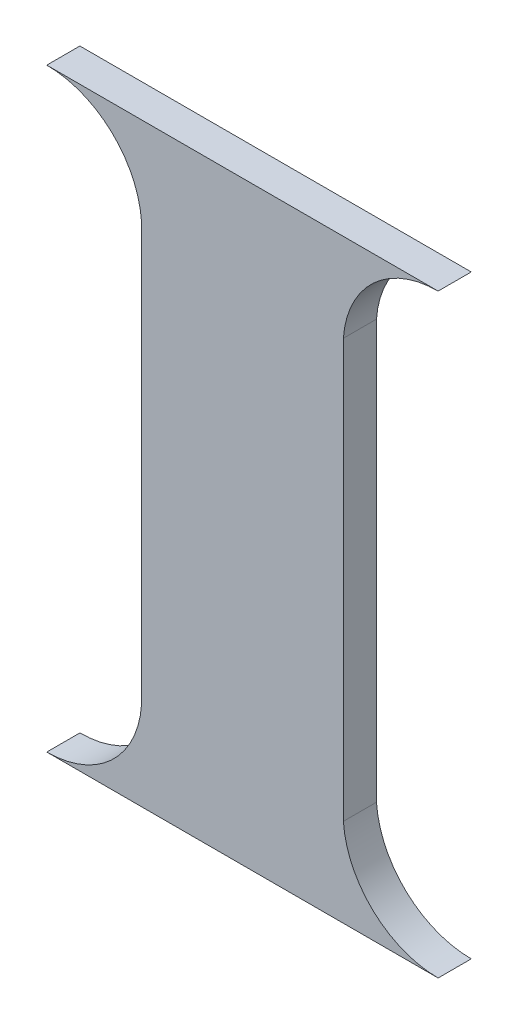
ISO-10303-21;
HEADER;
FILE_DESCRIPTION(('STEP AP214'),'2;1');
FILE_NAME('part.step','',(''),(''),'','','');
FILE_SCHEMA(('AUTOMOTIVE_DESIGN { 1 0 10303 214 1 1 1 1 }'));
ENDSEC;
DATA;
#1=APPLICATION_CONTEXT('core data for automotive mechanical design processes');
#2=APPLICATION_PROTOCOL_DEFINITION('international standard','automotive_design',2000,#1);
#3=PRODUCT_CONTEXT('',#1,'mechanical');
#4=PRODUCT('Part','Part','',(#3));
#5=PRODUCT_RELATED_PRODUCT_CATEGORY('part','',(#4));
#6=PRODUCT_DEFINITION_FORMATION('','',#4);
#7=PRODUCT_DEFINITION_CONTEXT('part definition',#1,'design');
#8=PRODUCT_DEFINITION('design','',#6,#7);
#9=PRODUCT_DEFINITION_SHAPE('','',#8);
#10=(LENGTH_UNIT() NAMED_UNIT(*) SI_UNIT(.MILLI.,.METRE.));
#11=(NAMED_UNIT(*) PLANE_ANGLE_UNIT() SI_UNIT($,.RADIAN.));
#12=(NAMED_UNIT(*) SI_UNIT($,.STERADIAN.) SOLID_ANGLE_UNIT());
#13=UNCERTAINTY_MEASURE_WITH_UNIT(LENGTH_MEASURE(1.E-05),#10,'distance_accuracy_value','');
#14=(GEOMETRIC_REPRESENTATION_CONTEXT(3) GLOBAL_UNCERTAINTY_ASSIGNED_CONTEXT((#13)) GLOBAL_UNIT_ASSIGNED_CONTEXT((#10,
#11,#12)) REPRESENTATION_CONTEXT('',''));
#15=CARTESIAN_POINT('',(0.,0.,0.));
#16=DIRECTION('',(0.,0.,1.));
#17=DIRECTION('',(1.,0.,0.));
#18=AXIS2_PLACEMENT_3D('',#15,#16,#17);
#19=CARTESIAN_POINT('',(8389.70437042069,315.598663005312,110.));
#20=DIRECTION('',(0.,0.,-1.));
#21=DIRECTION('',(-1.,0.,0.));
#22=AXIS2_PLACEMENT_3D('',#19,#20,#21);
#23=CYLINDRICAL_SURFACE('',#22,315.598663005312);
#24=CARTESIAN_POINT('',(8389.70437042069,315.598663005312,0.));
#25=DIRECTION('',(0.,0.,-1.));
#26=DIRECTION('',(1.,0.,0.));
#27=AXIS2_PLACEMENT_3D('',#24,#25,#26);
#28=CIRCLE('',#27,315.598663005312);
#29=CARTESIAN_POINT('',(8704.50700095543,293.197326010618,0.));
#30=VERTEX_POINT('',#29);
#31=CARTESIAN_POINT('',(8389.70437042069,0.,0.));
#32=VERTEX_POINT('',#31);
#33=EDGE_CURVE('E142',#30,#32,#28,.T.);
#34=ORIENTED_EDGE('',*,*,#33,.T.);
#35=DIRECTION('',(0.,0.,-1.));
#36=VECTOR('',#35,1.);
#37=CARTESIAN_POINT('',(8389.70437042069,0.,110.));
#38=LINE('',#37,#36);
#39=CARTESIAN_POINT('',(8389.70437042069,0.,110.));
#40=VERTEX_POINT('',#39);
#41=EDGE_CURVE('E11',#40,#32,#38,.T.);
#42=ORIENTED_EDGE('',*,*,#41,.F.);
#43=CARTESIAN_POINT('',(8389.70437042069,315.598663005312,110.));
#44=DIRECTION('',(0.,0.,-1.));
#45=DIRECTION('',(1.,0.,0.));
#46=AXIS2_PLACEMENT_3D('',#43,#44,#45);
#47=CIRCLE('',#46,315.598663005312);
#48=CARTESIAN_POINT('',(8704.50700095543,293.197326010618,110.));
#49=VERTEX_POINT('',#48);
#50=EDGE_CURVE('E164',#49,#40,#47,.T.);
#51=ORIENTED_EDGE('',*,*,#50,.F.);
#52=DIRECTION('',(0.,0.,-1.));
#53=VECTOR('',#52,1.);
#54=CARTESIAN_POINT('',(8704.50700095543,293.197326010618,110.));
#55=LINE('',#54,#53);
#56=EDGE_CURVE('E138',#49,#30,#55,.T.);
#57=ORIENTED_EDGE('',*,*,#56,.T.);
#58=EDGE_LOOP('',(#34,#42,#51,#57));
#59=FACE_BOUND('',#58,.T.);
#60=ADVANCED_FACE('F41',(#59),#23,.F.);
#61=CARTESIAN_POINT('',(8389.70437042069,0.,110.));
#62=DIRECTION('',(0.,1.,0.));
#63=DIRECTION('',(0.,0.,1.));
#64=AXIS2_PLACEMENT_3D('',#61,#62,#63);
#65=PLANE('',#64);
#66=DIRECTION('',(1.,0.,0.));
#67=VECTOR('',#66,1.);
#68=CARTESIAN_POINT('',(8389.70437042069,0.,0.));
#69=LINE('',#68,#67);
#70=CARTESIAN_POINT('',(9689.70437042069,2.77555756156289E-13,0.));
#71=VERTEX_POINT('',#70);
#72=EDGE_CURVE('E146',#32,#71,#69,.T.);
#73=ORIENTED_EDGE('',*,*,#72,.T.);
#74=DIRECTION('',(0.,0.,-1.));
#75=VECTOR('',#74,1.);
#76=CARTESIAN_POINT('',(9689.70437042069,2.77555756156289E-13,110.));
#77=LINE('',#76,#75);
#78=CARTESIAN_POINT('',(9689.70437042069,2.77555756156289E-13,110.));
#79=VERTEX_POINT('',#78);
#80=EDGE_CURVE('E50',#79,#71,#77,.T.);
#81=ORIENTED_EDGE('',*,*,#80,.F.);
#82=DIRECTION('',(1.,0.,0.));
#83=VECTOR('',#82,1.);
#84=CARTESIAN_POINT('',(8389.70437042069,0.,110.));
#85=LINE('',#84,#83);
#86=EDGE_CURVE('E101',#40,#79,#85,.T.);
#87=ORIENTED_EDGE('',*,*,#86,.F.);
#88=ORIENTED_EDGE('',*,*,#41,.T.);
#89=EDGE_LOOP('',(#73,#81,#87,#88));
#90=FACE_BOUND('',#89,.T.);
#91=ADVANCED_FACE('F210',(#90),#65,.F.);
#92=CARTESIAN_POINT('',(9689.70437042069,315.598663005312,110.));
#93=DIRECTION('',(0.,0.,-1.));
#94=DIRECTION('',(-1.,0.,0.));
#95=AXIS2_PLACEMENT_3D('',#92,#93,#94);
#96=CYLINDRICAL_SURFACE('',#95,315.598663005312);
#97=CARTESIAN_POINT('',(9689.70437042069,315.598663005312,0.));
#98=DIRECTION('',(0.,0.,-1.));
#99=DIRECTION('',(-1.,0.,0.));
#100=AXIS2_PLACEMENT_3D('',#97,#98,#99);
#101=CIRCLE('',#100,315.598663005312);
#102=CARTESIAN_POINT('',(9374.90173988596,293.197326010618,0.));
#103=VERTEX_POINT('',#102);
#104=EDGE_CURVE('E149',#71,#103,#101,.T.);
#105=ORIENTED_EDGE('',*,*,#104,.T.);
#106=DIRECTION('',(0.,0.,-1.));
#107=VECTOR('',#106,1.);
#108=CARTESIAN_POINT('',(9374.90173988596,293.197326010618,110.));
#109=LINE('',#108,#107);
#110=CARTESIAN_POINT('',(9374.90173988596,293.197326010618,110.));
#111=VERTEX_POINT('',#110);
#112=EDGE_CURVE('E175',#111,#103,#109,.T.);
#113=ORIENTED_EDGE('',*,*,#112,.F.);
#114=CARTESIAN_POINT('',(9689.70437042069,315.598663005312,110.));
#115=DIRECTION('',(0.,0.,-1.));
#116=DIRECTION('',(-1.,0.,0.));
#117=AXIS2_PLACEMENT_3D('',#114,#115,#116);
#118=CIRCLE('',#117,315.598663005312);
#119=EDGE_CURVE('E185',#79,#111,#118,.T.);
#120=ORIENTED_EDGE('',*,*,#119,.F.);
#121=ORIENTED_EDGE('',*,*,#80,.T.);
#122=EDGE_LOOP('',(#105,#113,#120,#121));
#123=FACE_BOUND('',#122,.T.);
#124=ADVANCED_FACE('F183',(#123),#96,.F.);
#125=CARTESIAN_POINT('',(9374.90173988596,293.197326010618,110.));
#126=DIRECTION('',(-1.,0.,0.));
#127=DIRECTION('',(0.,0.,1.));
#128=AXIS2_PLACEMENT_3D('',#125,#126,#127);
#129=PLANE('',#128);
#130=DIRECTION('',(0.,1.,0.));
#131=VECTOR('',#130,1.);
#132=CARTESIAN_POINT('',(9374.90173988596,293.197326010618,0.));
#133=LINE('',#132,#131);
#134=CARTESIAN_POINT('',(9374.90173988596,1682.80267398938,0.));
#135=VERTEX_POINT('',#134);
#136=EDGE_CURVE('E152',#103,#135,#133,.T.);
#137=ORIENTED_EDGE('',*,*,#136,.T.);
#138=DIRECTION('',(0.,0.,-1.));
#139=VECTOR('',#138,1.);
#140=CARTESIAN_POINT('',(9374.90173988596,1682.80267398938,110.));
#141=LINE('',#140,#139);
#142=CARTESIAN_POINT('',(9374.90173988596,1682.80267398938,110.));
#143=VERTEX_POINT('',#142);
#144=EDGE_CURVE('E171',#143,#135,#141,.T.);
#145=ORIENTED_EDGE('',*,*,#144,.F.);
#146=DIRECTION('',(0.,1.,0.));
#147=VECTOR('',#146,1.);
#148=CARTESIAN_POINT('',(9374.90173988596,293.197326010618,110.));
#149=LINE('',#148,#147);
#150=EDGE_CURVE('E198',#111,#143,#149,.T.);
#151=ORIENTED_EDGE('',*,*,#150,.F.);
#152=ORIENTED_EDGE('',*,*,#112,.T.);
#153=EDGE_LOOP('',(#137,#145,#151,#152));
#154=FACE_BOUND('',#153,.T.);
#155=ADVANCED_FACE('F193',(#154),#129,.F.);
#156=CARTESIAN_POINT('',(9689.70437042069,1660.40133699469,110.));
#157=DIRECTION('',(0.,0.,-1.));
#158=DIRECTION('',(-1.,0.,0.));
#159=AXIS2_PLACEMENT_3D('',#156,#157,#158);
#160=CYLINDRICAL_SURFACE('',#159,315.598663005312);
#161=CARTESIAN_POINT('',(9689.70437042069,1660.40133699469,0.));
#162=DIRECTION('',(0.,0.,-1.));
#163=DIRECTION('',(-1.,0.,0.));
#164=AXIS2_PLACEMENT_3D('',#161,#162,#163);
#165=CIRCLE('',#164,315.598663005312);
#166=CARTESIAN_POINT('',(9689.70437042069,1976.,0.));
#167=VERTEX_POINT('',#166);
#168=EDGE_CURVE('E155',#135,#167,#165,.T.);
#169=ORIENTED_EDGE('',*,*,#168,.T.);
#170=DIRECTION('',(0.,0.,-1.));
#171=VECTOR('',#170,1.);
#172=CARTESIAN_POINT('',(9689.70437042069,1976.,110.));
#173=LINE('',#172,#171);
#174=CARTESIAN_POINT('',(9689.70437042069,1976.,110.));
#175=VERTEX_POINT('',#174);
#176=EDGE_CURVE('E131',#175,#167,#173,.T.);
#177=ORIENTED_EDGE('',*,*,#176,.F.);
#178=CARTESIAN_POINT('',(9689.70437042069,1660.40133699469,110.));
#179=DIRECTION('',(0.,0.,-1.));
#180=DIRECTION('',(-1.,0.,0.));
#181=AXIS2_PLACEMENT_3D('',#178,#179,#180);
#182=CIRCLE('',#181,315.598663005312);
#183=EDGE_CURVE('E120',#143,#175,#182,.T.);
#184=ORIENTED_EDGE('',*,*,#183,.F.);
#185=ORIENTED_EDGE('',*,*,#144,.T.);
#186=EDGE_LOOP('',(#169,#177,#184,#185));
#187=FACE_BOUND('',#186,.T.);
#188=ADVANCED_FACE('F196',(#187),#160,.F.);
#189=CARTESIAN_POINT('',(8389.70437042069,1976.,110.));
#190=DIRECTION('',(0.,-1.,0.));
#191=DIRECTION('',(0.,0.,-1.));
#192=AXIS2_PLACEMENT_3D('',#189,#190,#191);
#193=PLANE('',#192);
#194=DIRECTION('',(-1.,0.,0.));
#195=VECTOR('',#194,1.);
#196=CARTESIAN_POINT('',(8389.70437042069,1976.,0.));
#197=LINE('',#196,#195);
#198=CARTESIAN_POINT('',(8389.70437042069,1976.,0.));
#199=VERTEX_POINT('',#198);
#200=EDGE_CURVE('E129',#167,#199,#197,.T.);
#201=ORIENTED_EDGE('',*,*,#200,.T.);
#202=DIRECTION('',(0.,0.,-1.));
#203=VECTOR('',#202,1.);
#204=CARTESIAN_POINT('',(8389.70437042069,1976.,110.));
#205=LINE('',#204,#203);
#206=CARTESIAN_POINT('',(8389.70437042069,1976.,110.));
#207=VERTEX_POINT('',#206);
#208=EDGE_CURVE('E126',#207,#199,#205,.T.);
#209=ORIENTED_EDGE('',*,*,#208,.F.);
#210=DIRECTION('',(-1.,0.,0.));
#211=VECTOR('',#210,1.);
#212=CARTESIAN_POINT('',(8389.70437042069,1976.,110.));
#213=LINE('',#212,#211);
#214=EDGE_CURVE('E114',#175,#207,#213,.T.);
#215=ORIENTED_EDGE('',*,*,#214,.F.);
#216=ORIENTED_EDGE('',*,*,#176,.T.);
#217=EDGE_LOOP('',(#201,#209,#215,#216));
#218=FACE_BOUND('',#217,.T.);
#219=ADVANCED_FACE('F127',(#218),#193,.F.);
#220=CARTESIAN_POINT('',(8389.70437042069,1660.40133699469,110.));
#221=DIRECTION('',(0.,0.,-1.));
#222=DIRECTION('',(-1.,0.,0.));
#223=AXIS2_PLACEMENT_3D('',#220,#221,#222);
#224=CYLINDRICAL_SURFACE('',#223,315.598663005312);
#225=CARTESIAN_POINT('',(8389.70437042069,1660.40133699469,0.));
#226=DIRECTION('',(0.,0.,-1.));
#227=DIRECTION('',(1.,0.,0.));
#228=AXIS2_PLACEMENT_3D('',#225,#226,#227);
#229=CIRCLE('',#228,315.598663005312);
#230=CARTESIAN_POINT('',(8704.50700095543,1682.80267398938,0.));
#231=VERTEX_POINT('',#230);
#232=EDGE_CURVE('E87',#199,#231,#229,.T.);
#233=ORIENTED_EDGE('',*,*,#232,.T.);
#234=DIRECTION('',(0.,0.,-1.));
#235=VECTOR('',#234,1.);
#236=CARTESIAN_POINT('',(8704.50700095543,1682.80267398938,110.));
#237=LINE('',#236,#235);
#238=CARTESIAN_POINT('',(8704.50700095543,1682.80267398938,110.));
#239=VERTEX_POINT('',#238);
#240=EDGE_CURVE('E132',#239,#231,#237,.T.);
#241=ORIENTED_EDGE('',*,*,#240,.F.);
#242=CARTESIAN_POINT('',(8389.70437042069,1660.40133699469,110.));
#243=DIRECTION('',(0.,0.,-1.));
#244=DIRECTION('',(1.,0.,0.));
#245=AXIS2_PLACEMENT_3D('',#242,#243,#244);
#246=CIRCLE('',#245,315.598663005312);
#247=EDGE_CURVE('E118',#207,#239,#246,.T.);
#248=ORIENTED_EDGE('',*,*,#247,.F.);
#249=ORIENTED_EDGE('',*,*,#208,.T.);
#250=EDGE_LOOP('',(#233,#241,#248,#249));
#251=FACE_BOUND('',#250,.T.);
#252=ADVANCED_FACE('F134',(#251),#224,.F.);
#253=CARTESIAN_POINT('',(8704.50700095543,293.197326010618,110.));
#254=DIRECTION('',(1.,0.,0.));
#255=DIRECTION('',(0.,0.,-1.));
#256=AXIS2_PLACEMENT_3D('',#253,#254,#255);
#257=PLANE('',#256);
#258=DIRECTION('',(0.,-1.,0.));
#259=VECTOR('',#258,1.);
#260=CARTESIAN_POINT('',(8704.50700095543,293.197326010618,0.));
#261=LINE('',#260,#259);
#262=EDGE_CURVE('E93',#231,#30,#261,.T.);
#263=ORIENTED_EDGE('',*,*,#262,.T.);
#264=ORIENTED_EDGE('',*,*,#56,.F.);
#265=DIRECTION('',(0.,-1.,0.));
#266=VECTOR('',#265,1.);
#267=CARTESIAN_POINT('',(8704.50700095543,293.197326010618,110.));
#268=LINE('',#267,#266);
#269=EDGE_CURVE('E58',#239,#49,#268,.T.);
#270=ORIENTED_EDGE('',*,*,#269,.F.);
#271=ORIENTED_EDGE('',*,*,#240,.T.);
#272=EDGE_LOOP('',(#263,#264,#270,#271));
#273=FACE_BOUND('',#272,.T.);
#274=ADVANCED_FACE('F226',(#273),#257,.F.);
#275=CARTESIAN_POINT('',(8389.70437042069,315.598663005312,110.));
#276=DIRECTION('',(0.,0.,1.));
#277=DIRECTION('',(1.,0.,0.));
#278=AXIS2_PLACEMENT_3D('',#275,#276,#277);
#279=PLANE('',#278);
#280=ORIENTED_EDGE('',*,*,#50,.T.);
#281=ORIENTED_EDGE('',*,*,#86,.T.);
#282=ORIENTED_EDGE('',*,*,#119,.T.);
#283=ORIENTED_EDGE('',*,*,#150,.T.);
#284=ORIENTED_EDGE('',*,*,#183,.T.);
#285=ORIENTED_EDGE('',*,*,#214,.T.);
#286=ORIENTED_EDGE('',*,*,#247,.T.);
#287=ORIENTED_EDGE('',*,*,#269,.T.);
#288=EDGE_LOOP('',(#280,#281,#282,#283,#284,#285,#286,#287));
#289=FACE_BOUND('',#288,.T.);
#290=ADVANCED_FACE('F116',(#289),#279,.T.);
#291=CARTESIAN_POINT('',(8389.70437042069,315.598663005312,0.));
#292=DIRECTION('',(0.,0.,1.));
#293=DIRECTION('',(1.,0.,0.));
#294=AXIS2_PLACEMENT_3D('',#291,#292,#293);
#295=PLANE('',#294);
#296=ORIENTED_EDGE('',*,*,#33,.F.);
#297=ORIENTED_EDGE('',*,*,#262,.F.);
#298=ORIENTED_EDGE('',*,*,#232,.F.);
#299=ORIENTED_EDGE('',*,*,#200,.F.);
#300=ORIENTED_EDGE('',*,*,#168,.F.);
#301=ORIENTED_EDGE('',*,*,#136,.F.);
#302=ORIENTED_EDGE('',*,*,#104,.F.);
#303=ORIENTED_EDGE('',*,*,#72,.F.);
#304=EDGE_LOOP('',(#296,#297,#298,#299,#300,#301,#302,#303));
#305=FACE_BOUND('',#304,.T.);
#306=ADVANCED_FACE('F189',(#305),#295,.F.);
#307=CLOSED_SHELL('',(#60,#91,#124,#155,#188,#219,#252,#274,#290,#306));
#308=MANIFOLD_SOLID_BREP('B2',#307);
#309=ADVANCED_BREP_SHAPE_REPRESENTATION('',(#18,#308),#14);
#310=SHAPE_DEFINITION_REPRESENTATION(#9,#309);
ENDSEC;
END-ISO-10303-21;
